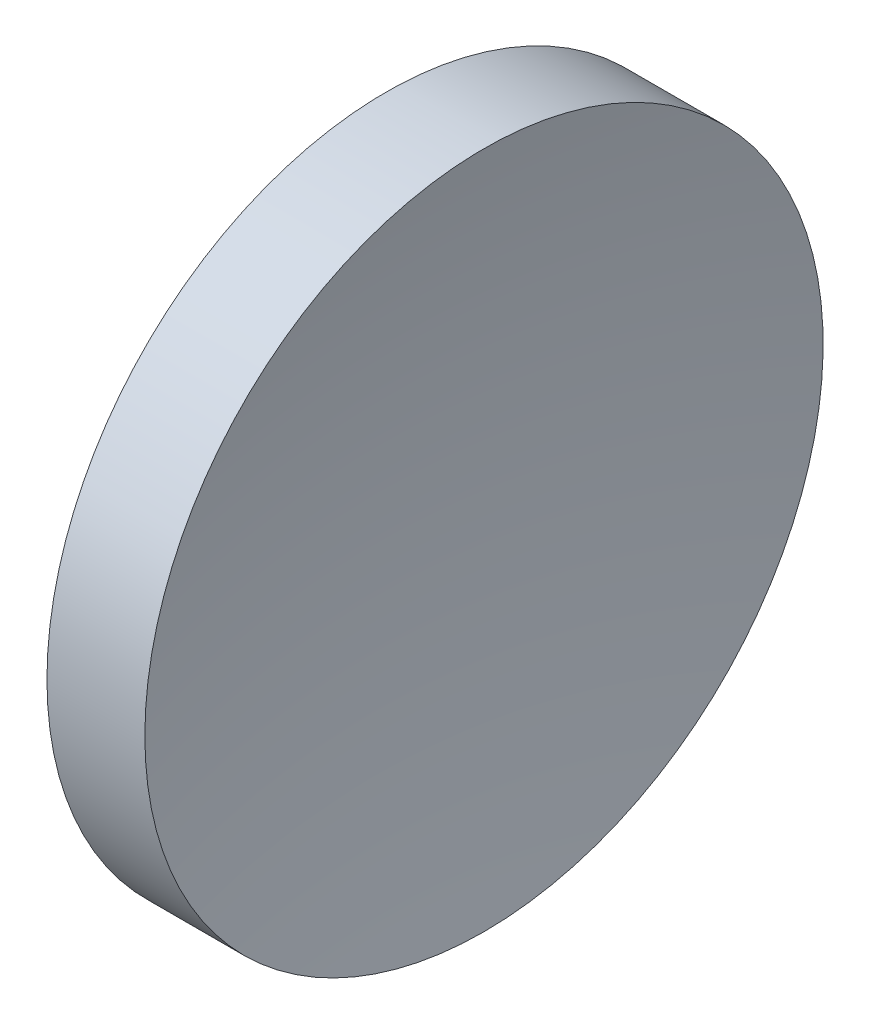
ISO-10303-21;
HEADER;
FILE_DESCRIPTION(('STEP AP214'),'2;1');
FILE_NAME('part.step','',(''),(''),'','','');
FILE_SCHEMA(('AUTOMOTIVE_DESIGN { 1 0 10303 214 1 1 1 1 }'));
ENDSEC;
DATA;
#1=APPLICATION_CONTEXT('core data for automotive mechanical design processes');
#2=APPLICATION_PROTOCOL_DEFINITION('international standard','automotive_design',2000,#1);
#3=PRODUCT_CONTEXT('',#1,'mechanical');
#4=PRODUCT('Part','Part','',(#3));
#5=PRODUCT_RELATED_PRODUCT_CATEGORY('part','',(#4));
#6=PRODUCT_DEFINITION_FORMATION('','',#4);
#7=PRODUCT_DEFINITION_CONTEXT('part definition',#1,'design');
#8=PRODUCT_DEFINITION('design','',#6,#7);
#9=PRODUCT_DEFINITION_SHAPE('','',#8);
#10=(LENGTH_UNIT() NAMED_UNIT(*) SI_UNIT(.MILLI.,.METRE.));
#11=(NAMED_UNIT(*) PLANE_ANGLE_UNIT() SI_UNIT($,.RADIAN.));
#12=(NAMED_UNIT(*) SI_UNIT($,.STERADIAN.) SOLID_ANGLE_UNIT());
#13=UNCERTAINTY_MEASURE_WITH_UNIT(LENGTH_MEASURE(1.E-05),#10,'distance_accuracy_value','');
#14=(GEOMETRIC_REPRESENTATION_CONTEXT(3) GLOBAL_UNCERTAINTY_ASSIGNED_CONTEXT((#13)) GLOBAL_UNIT_ASSIGNED_CONTEXT((#10,
#11,#12)) REPRESENTATION_CONTEXT('',''));
#15=CARTESIAN_POINT('',(0.,0.,0.));
#16=DIRECTION('',(0.,0.,1.));
#17=DIRECTION('',(1.,0.,0.));
#18=AXIS2_PLACEMENT_3D('',#15,#16,#17);
#19=CARTESIAN_POINT('',(206.314634685188,65.2215362584536,0.));
#20=DIRECTION('',(-1.,0.,0.));
#21=DIRECTION('',(0.,-1.,0.));
#22=AXIS2_PLACEMENT_3D('',#19,#20,#21);
#23=SPHERICAL_SURFACE('',#22,88.);
#24=CARTESIAN_POINT('',(119.972292812848,65.2215362584536,0.));
#25=DIRECTION('',(-1.,0.,0.));
#26=DIRECTION('',(0.,0.,1.));
#27=AXIS2_PLACEMENT_3D('',#24,#25,#26);
#28=CIRCLE('',#27,17.);
#29=CARTESIAN_POINT('',(119.972292812848,65.2215362584536,17.));
#30=VERTEX_POINT('',#29);
#31=EDGE_CURVE('E10',#30,#30,#28,.T.);
#32=ORIENTED_EDGE('',*,*,#31,.F.);
#33=EDGE_LOOP('',(#32));
#34=FACE_BOUND('',#33,.T.);
#35=ADVANCED_FACE('F35',(#34),#23,.F.);
#36=CARTESIAN_POINT('',(103.233342165814,65.2215362584536,0.));
#37=DIRECTION('',(-1.,0.,0.));
#38=DIRECTION('',(0.,0.,1.));
#39=AXIS2_PLACEMENT_3D('',#36,#37,#38);
#40=CYLINDRICAL_SURFACE('',#39,17.);
#41=CARTESIAN_POINT('',(115.064634685188,65.2215362584536,0.));
#42=DIRECTION('',(-1.,0.,0.));
#43=DIRECTION('',(0.,0.,1.));
#44=AXIS2_PLACEMENT_3D('',#41,#42,#43);
#45=CIRCLE('',#44,17.);
#46=CARTESIAN_POINT('',(115.064634685188,65.2215362584536,17.));
#47=VERTEX_POINT('',#46);
#48=EDGE_CURVE('E41',#47,#47,#45,.T.);
#49=ORIENTED_EDGE('',*,*,#48,.F.);
#50=EDGE_LOOP('',(#49));
#51=FACE_BOUND('',#50,.T.);
#52=ORIENTED_EDGE('',*,*,#31,.T.);
#53=EDGE_LOOP('',(#52));
#54=FACE_BOUND('',#53,.T.);
#55=ADVANCED_FACE('F49',(#51,#54),#40,.T.);
#56=CARTESIAN_POINT('',(115.064634685188,65.2215362584536,0.));
#57=DIRECTION('',(1.,0.,0.));
#58=DIRECTION('',(0.,0.,-1.));
#59=AXIS2_PLACEMENT_3D('',#56,#57,#58);
#60=PLANE('',#59);
#61=ORIENTED_EDGE('',*,*,#48,.T.);
#62=EDGE_LOOP('',(#61));
#63=FACE_BOUND('',#62,.T.);
#64=ADVANCED_FACE('F47',(#63),#60,.F.);
#65=CLOSED_SHELL('',(#35,#55,#64));
#66=MANIFOLD_SOLID_BREP('B2',#65);
#67=ADVANCED_BREP_SHAPE_REPRESENTATION('',(#18,#66),#14);
#68=SHAPE_DEFINITION_REPRESENTATION(#9,#67);
ENDSEC;
END-ISO-10303-21;
